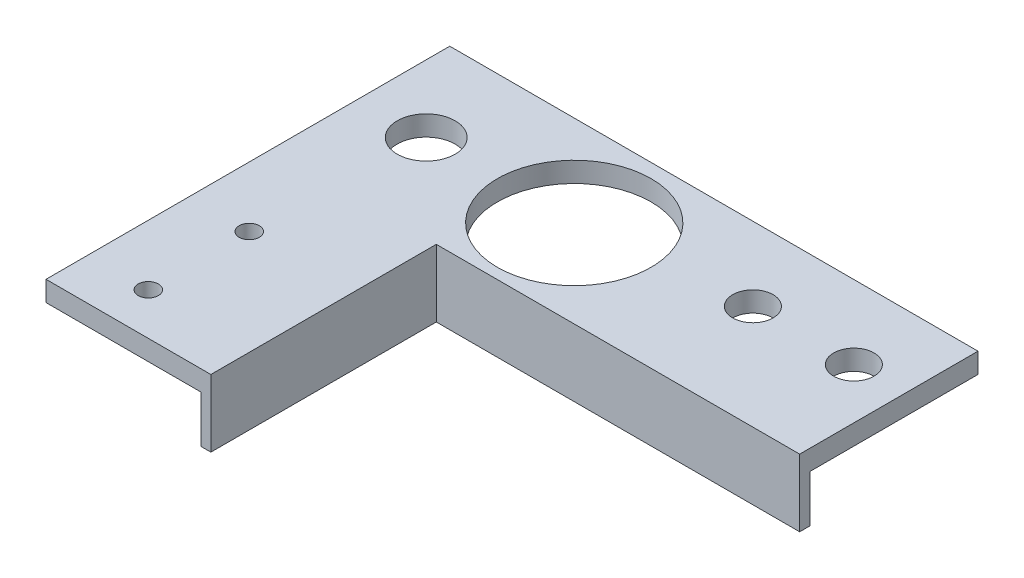
ISO-10303-21;
HEADER;
FILE_DESCRIPTION(('STEP AP214'),'2;1');
FILE_NAME('part.step','',(''),(''),'','','');
FILE_SCHEMA(('AUTOMOTIVE_DESIGN { 1 0 10303 214 1 1 1 1 }'));
ENDSEC;
DATA;
#1=APPLICATION_CONTEXT('core data for automotive mechanical design processes');
#2=APPLICATION_PROTOCOL_DEFINITION('international standard','automotive_design',2000,#1);
#3=PRODUCT_CONTEXT('',#1,'mechanical');
#4=PRODUCT('Part','Part','',(#3));
#5=PRODUCT_RELATED_PRODUCT_CATEGORY('part','',(#4));
#6=PRODUCT_DEFINITION_FORMATION('','',#4);
#7=PRODUCT_DEFINITION_CONTEXT('part definition',#1,'design');
#8=PRODUCT_DEFINITION('design','',#6,#7);
#9=PRODUCT_DEFINITION_SHAPE('','',#8);
#10=(LENGTH_UNIT() NAMED_UNIT(*) SI_UNIT(.MILLI.,.METRE.));
#11=(NAMED_UNIT(*) PLANE_ANGLE_UNIT() SI_UNIT($,.RADIAN.));
#12=(NAMED_UNIT(*) SI_UNIT($,.STERADIAN.) SOLID_ANGLE_UNIT());
#13=UNCERTAINTY_MEASURE_WITH_UNIT(LENGTH_MEASURE(1.E-05),#10,'distance_accuracy_value','');
#14=(GEOMETRIC_REPRESENTATION_CONTEXT(3) GLOBAL_UNCERTAINTY_ASSIGNED_CONTEXT((#13)) GLOBAL_UNIT_ASSIGNED_CONTEXT((#10,
#11,#12)) REPRESENTATION_CONTEXT('',''));
#15=CARTESIAN_POINT('',(0.,0.,0.));
#16=DIRECTION('',(0.,0.,1.));
#17=DIRECTION('',(1.,0.,0.));
#18=AXIS2_PLACEMENT_3D('',#15,#16,#17);
#19=CARTESIAN_POINT('',(39.25,3.,-29.));
#20=DIRECTION('',(-1.,0.,0.));
#21=DIRECTION('',(0.,0.,-1.));
#22=AXIS2_PLACEMENT_3D('',#19,#20,#21);
#23=PLANE('',#22);
#24=DIRECTION('',(0.,0.,1.));
#25=VECTOR('',#24,1.);
#26=CARTESIAN_POINT('',(39.25,0.,-29.));
#27=LINE('',#26,#25);
#28=CARTESIAN_POINT('',(39.25,0.,-31.));
#29=VERTEX_POINT('',#28);
#30=CARTESIAN_POINT('',(39.25,0.,-6.));
#31=VERTEX_POINT('',#30);
#32=EDGE_CURVE('E94',#29,#31,#27,.T.);
#33=ORIENTED_EDGE('',*,*,#32,.F.);
#34=DIRECTION('',(0.,1.,0.));
#35=VECTOR('',#34,1.);
#36=CARTESIAN_POINT('',(39.25,0.,-31.));
#37=LINE('',#36,#35);
#38=CARTESIAN_POINT('',(39.25,3.,-31.));
#39=VERTEX_POINT('',#38);
#40=EDGE_CURVE('E118',#29,#39,#37,.T.);
#41=ORIENTED_EDGE('',*,*,#40,.T.);
#42=DIRECTION('',(0.,0.,1.));
#43=VECTOR('',#42,1.);
#44=CARTESIAN_POINT('',(39.25,3.,-29.));
#45=LINE('',#44,#43);
#46=CARTESIAN_POINT('',(39.25,3.,-4.5));
#47=VERTEX_POINT('',#46);
#48=EDGE_CURVE('E103',#39,#47,#45,.T.);
#49=ORIENTED_EDGE('',*,*,#48,.T.);
#50=DIRECTION('',(0.,1.,0.));
#51=VECTOR('',#50,1.);
#52=CARTESIAN_POINT('',(39.25,-7.,-4.5));
#53=LINE('',#52,#51);
#54=CARTESIAN_POINT('',(39.25,-7.,-4.5));
#55=VERTEX_POINT('',#54);
#56=EDGE_CURVE('E147',#55,#47,#53,.T.);
#57=ORIENTED_EDGE('',*,*,#56,.F.);
#58=DIRECTION('',(0.,0.,1.));
#59=VECTOR('',#58,1.);
#60=CARTESIAN_POINT('',(39.25,-7.,-6.));
#61=LINE('',#60,#59);
#62=CARTESIAN_POINT('',(39.25,-7.,-6.));
#63=VERTEX_POINT('',#62);
#64=EDGE_CURVE('E129',#63,#55,#61,.T.);
#65=ORIENTED_EDGE('',*,*,#64,.F.);
#66=DIRECTION('',(0.,1.,0.));
#67=VECTOR('',#66,1.);
#68=CARTESIAN_POINT('',(39.25,-7.,-6.));
#69=LINE('',#68,#67);
#70=EDGE_CURVE('E77',#63,#31,#69,.T.);
#71=ORIENTED_EDGE('',*,*,#70,.T.);
#72=EDGE_LOOP('',(#33,#41,#49,#57,#65,#71));
#73=FACE_BOUND('',#72,.T.);
#74=ADVANCED_FACE('F35',(#73),#23,.F.);
#75=CARTESIAN_POINT('',(-16.25,3.,29.));
#76=DIRECTION('',(0.,0.,-1.));
#77=DIRECTION('',(1.,0.,0.));
#78=AXIS2_PLACEMENT_3D('',#75,#76,#77);
#79=PLANE('',#78);
#80=DIRECTION('',(-1.,0.,0.));
#81=VECTOR('',#80,1.);
#82=CARTESIAN_POINT('',(-16.25,0.,29.));
#83=LINE('',#82,#81);
#84=CARTESIAN_POINT('',(-16.25,0.,29.));
#85=VERTEX_POINT('',#84);
#86=CARTESIAN_POINT('',(-39.25,0.,29.));
#87=VERTEX_POINT('',#86);
#88=EDGE_CURVE('E88',#85,#87,#83,.T.);
#89=ORIENTED_EDGE('',*,*,#88,.F.);
#90=DIRECTION('',(0.,1.,0.));
#91=VECTOR('',#90,1.);
#92=CARTESIAN_POINT('',(-16.25,-7.,29.));
#93=LINE('',#92,#91);
#94=CARTESIAN_POINT('',(-16.25,-7.,29.));
#95=VERTEX_POINT('',#94);
#96=EDGE_CURVE('E78',#95,#85,#93,.T.);
#97=ORIENTED_EDGE('',*,*,#96,.F.);
#98=DIRECTION('',(-1.,0.,0.));
#99=VECTOR('',#98,1.);
#100=CARTESIAN_POINT('',(-14.75,-7.,29.));
#101=LINE('',#100,#99);
#102=CARTESIAN_POINT('',(-14.75,-7.,29.));
#103=VERTEX_POINT('',#102);
#104=EDGE_CURVE('E122',#103,#95,#101,.T.);
#105=ORIENTED_EDGE('',*,*,#104,.F.);
#106=DIRECTION('',(0.,1.,0.));
#107=VECTOR('',#106,1.);
#108=CARTESIAN_POINT('',(-14.75,-7.,29.));
#109=LINE('',#108,#107);
#110=CARTESIAN_POINT('',(-14.75,3.,29.));
#111=VERTEX_POINT('',#110);
#112=EDGE_CURVE('E140',#103,#111,#109,.T.);
#113=ORIENTED_EDGE('',*,*,#112,.T.);
#114=DIRECTION('',(-1.,0.,0.));
#115=VECTOR('',#114,1.);
#116=CARTESIAN_POINT('',(-16.25,3.,29.));
#117=LINE('',#116,#115);
#118=CARTESIAN_POINT('',(-39.25,3.,29.));
#119=VERTEX_POINT('',#118);
#120=EDGE_CURVE('E176',#111,#119,#117,.T.);
#121=ORIENTED_EDGE('',*,*,#120,.T.);
#122=DIRECTION('',(0.,-1.,0.));
#123=VECTOR('',#122,1.);
#124=CARTESIAN_POINT('',(-39.25,3.,29.));
#125=LINE('',#124,#123);
#126=EDGE_CURVE('E11',#119,#87,#125,.T.);
#127=ORIENTED_EDGE('',*,*,#126,.T.);
#128=EDGE_LOOP('',(#89,#97,#105,#113,#121,#127));
#129=FACE_BOUND('',#128,.T.);
#130=ADVANCED_FACE('F219',(#129),#79,.F.);
#131=CARTESIAN_POINT('',(-39.25,3.,29.));
#132=DIRECTION('',(1.,0.,0.));
#133=DIRECTION('',(0.,0.,1.));
#134=AXIS2_PLACEMENT_3D('',#131,#132,#133);
#135=PLANE('',#134);
#136=DIRECTION('',(0.,0.,-1.));
#137=VECTOR('',#136,1.);
#138=CARTESIAN_POINT('',(-39.25,0.,29.));
#139=LINE('',#138,#137);
#140=CARTESIAN_POINT('',(-39.25,0.,-31.));
#141=VERTEX_POINT('',#140);
#142=EDGE_CURVE('E101',#87,#141,#139,.T.);
#143=ORIENTED_EDGE('',*,*,#142,.F.);
#144=ORIENTED_EDGE('',*,*,#126,.F.);
#145=DIRECTION('',(0.,0.,-1.));
#146=VECTOR('',#145,1.);
#147=CARTESIAN_POINT('',(-39.25,3.,29.));
#148=LINE('',#147,#146);
#149=CARTESIAN_POINT('',(-39.25,3.,-31.));
#150=VERTEX_POINT('',#149);
#151=EDGE_CURVE('E44',#119,#150,#148,.T.);
#152=ORIENTED_EDGE('',*,*,#151,.T.);
#153=DIRECTION('',(0.,-1.,0.));
#154=VECTOR('',#153,1.);
#155=CARTESIAN_POINT('',(-39.25,0.,-31.));
#156=LINE('',#155,#154);
#157=EDGE_CURVE('E184',#150,#141,#156,.T.);
#158=ORIENTED_EDGE('',*,*,#157,.T.);
#159=EDGE_LOOP('',(#143,#144,#152,#158));
#160=FACE_BOUND('',#159,.T.);
#161=ADVANCED_FACE('F181',(#160),#135,.F.);
#162=CARTESIAN_POINT('',(0.,3.,0.));
#163=DIRECTION('',(0.,1.,0.));
#164=DIRECTION('',(0.,0.,-1.));
#165=AXIS2_PLACEMENT_3D('',#162,#163,#164);
#166=PLANE('',#165);
#167=CARTESIAN_POINT('',(-29.2499999999999,3.,-17.5));
#168=DIRECTION('',(0.,-1.,0.));
#169=DIRECTION('',(0.,0.,-1.));
#170=AXIS2_PLACEMENT_3D('',#167,#168,#169);
#171=CIRCLE('',#170,4.30465448526568);
#172=CARTESIAN_POINT('',(-29.2499999999999,3.,-21.8046544852657));
#173=VERTEX_POINT('',#172);
#174=EDGE_CURVE('E235',#173,#173,#171,.T.);
#175=ORIENTED_EDGE('',*,*,#174,.T.);
#176=EDGE_LOOP('',(#175));
#177=FACE_BOUND('',#176,.T.);
#178=CARTESIAN_POINT('',(-7.25000000000003,3.,-17.4999999999999));
#179=DIRECTION('',(0.,-1.,0.));
#180=DIRECTION('',(0.,0.,-1.));
#181=AXIS2_PLACEMENT_3D('',#178,#179,#180);
#182=CIRCLE('',#181,11.4206212485819);
#183=CARTESIAN_POINT('',(-7.25000000000003,3.,-28.9206212485818));
#184=VERTEX_POINT('',#183);
#185=EDGE_CURVE('E107',#184,#184,#182,.T.);
#186=ORIENTED_EDGE('',*,*,#185,.T.);
#187=EDGE_LOOP('',(#186));
#188=FACE_BOUND('',#187,.T.);
#189=CARTESIAN_POINT('',(-30.3,3.,7.75));
#190=DIRECTION('',(0.,-1.,0.));
#191=DIRECTION('',(0.,0.,-1.));
#192=AXIS2_PLACEMENT_3D('',#189,#190,#191);
#193=CIRCLE('',#192,1.5);
#194=CARTESIAN_POINT('',(-30.3,3.,6.25));
#195=VERTEX_POINT('',#194);
#196=EDGE_CURVE('E143',#195,#195,#193,.T.);
#197=ORIENTED_EDGE('',*,*,#196,.T.);
#198=EDGE_LOOP('',(#197));
#199=FACE_BOUND('',#198,.T.);
#200=CARTESIAN_POINT('',(-30.3,3.,22.75));
#201=DIRECTION('',(0.,-1.,0.));
#202=DIRECTION('',(0.,0.,-1.));
#203=AXIS2_PLACEMENT_3D('',#200,#201,#202);
#204=CIRCLE('',#203,1.5);
#205=CARTESIAN_POINT('',(-30.3,3.,21.25));
#206=VERTEX_POINT('',#205);
#207=EDGE_CURVE('E155',#206,#206,#204,.T.);
#208=ORIENTED_EDGE('',*,*,#207,.T.);
#209=EDGE_LOOP('',(#208));
#210=FACE_BOUND('',#209,.T.);
#211=CARTESIAN_POINT('',(16.75,3.,-20.05));
#212=DIRECTION('',(0.,-1.,0.));
#213=DIRECTION('',(0.,0.,-1.));
#214=AXIS2_PLACEMENT_3D('',#211,#212,#213);
#215=CIRCLE('',#214,3.);
#216=CARTESIAN_POINT('',(16.75,3.,-23.05));
#217=VERTEX_POINT('',#216);
#218=EDGE_CURVE('E161',#217,#217,#215,.T.);
#219=ORIENTED_EDGE('',*,*,#218,.T.);
#220=EDGE_LOOP('',(#219));
#221=FACE_BOUND('',#220,.T.);
#222=CARTESIAN_POINT('',(31.75,3.,-20.05));
#223=DIRECTION('',(0.,-1.,0.));
#224=DIRECTION('',(0.,0.,-1.));
#225=AXIS2_PLACEMENT_3D('',#222,#223,#224);
#226=CIRCLE('',#225,3.);
#227=CARTESIAN_POINT('',(31.75,3.,-23.05));
#228=VERTEX_POINT('',#227);
#229=EDGE_CURVE('E167',#228,#228,#226,.T.);
#230=ORIENTED_EDGE('',*,*,#229,.T.);
#231=EDGE_LOOP('',(#230));
#232=FACE_BOUND('',#231,.T.);
#233=ORIENTED_EDGE('',*,*,#151,.F.);
#234=ORIENTED_EDGE('',*,*,#120,.F.);
#235=DIRECTION('',(0.,0.,1.));
#236=VECTOR('',#235,1.);
#237=CARTESIAN_POINT('',(-14.75,3.,-4.50000000000001));
#238=LINE('',#237,#236);
#239=CARTESIAN_POINT('',(-14.75,3.,-4.50000000000001));
#240=VERTEX_POINT('',#239);
#241=EDGE_CURVE('E111',#240,#111,#238,.T.);
#242=ORIENTED_EDGE('',*,*,#241,.F.);
#243=DIRECTION('',(-1.,0.,0.));
#244=VECTOR('',#243,1.);
#245=CARTESIAN_POINT('',(39.25,3.,-4.5));
#246=LINE('',#245,#244);
#247=EDGE_CURVE('E106',#47,#240,#246,.T.);
#248=ORIENTED_EDGE('',*,*,#247,.F.);
#249=ORIENTED_EDGE('',*,*,#48,.F.);
#250=DIRECTION('',(-1.,0.,0.));
#251=VECTOR('',#250,1.);
#252=CARTESIAN_POINT('',(-39.25,3.,-31.));
#253=LINE('',#252,#251);
#254=EDGE_CURVE('E114',#39,#150,#253,.T.);
#255=ORIENTED_EDGE('',*,*,#254,.T.);
#256=EDGE_LOOP('',(#233,#234,#242,#248,#249,#255));
#257=FACE_BOUND('',#256,.T.);
#258=ADVANCED_FACE('F217',(#177,#188,#199,#210,#221,#232,#257),#166,.T.);
#259=CARTESIAN_POINT('',(0.,0.,0.));
#260=DIRECTION('',(0.,1.,0.));
#261=DIRECTION('',(0.,0.,-1.));
#262=AXIS2_PLACEMENT_3D('',#259,#260,#261);
#263=PLANE('',#262);
#264=CARTESIAN_POINT('',(-29.2499999999999,0.,-17.5));
#265=DIRECTION('',(0.,-1.,0.));
#266=DIRECTION('',(0.,0.,-1.));
#267=AXIS2_PLACEMENT_3D('',#264,#265,#266);
#268=CIRCLE('',#267,4.30465448526568);
#269=CARTESIAN_POINT('',(-29.2499999999999,0.,-21.8046544852657));
#270=VERTEX_POINT('',#269);
#271=EDGE_CURVE('E38',#270,#270,#268,.T.);
#272=ORIENTED_EDGE('',*,*,#271,.F.);
#273=EDGE_LOOP('',(#272));
#274=FACE_BOUND('',#273,.T.);
#275=CARTESIAN_POINT('',(-7.25000000000003,0.,-17.4999999999999));
#276=DIRECTION('',(0.,-1.,0.));
#277=DIRECTION('',(0.,0.,-1.));
#278=AXIS2_PLACEMENT_3D('',#275,#276,#277);
#279=CIRCLE('',#278,11.4206212485819);
#280=CARTESIAN_POINT('',(-7.25000000000003,0.,-28.9206212485818));
#281=VERTEX_POINT('',#280);
#282=EDGE_CURVE('E104',#281,#281,#279,.T.);
#283=ORIENTED_EDGE('',*,*,#282,.F.);
#284=EDGE_LOOP('',(#283));
#285=FACE_BOUND('',#284,.T.);
#286=CARTESIAN_POINT('',(-30.3,0.,7.75));
#287=DIRECTION('',(0.,-1.,0.));
#288=DIRECTION('',(0.,0.,-1.));
#289=AXIS2_PLACEMENT_3D('',#286,#287,#288);
#290=CIRCLE('',#289,1.5);
#291=CARTESIAN_POINT('',(-30.3,0.,6.25));
#292=VERTEX_POINT('',#291);
#293=EDGE_CURVE('E152',#292,#292,#290,.T.);
#294=ORIENTED_EDGE('',*,*,#293,.F.);
#295=EDGE_LOOP('',(#294));
#296=FACE_BOUND('',#295,.T.);
#297=CARTESIAN_POINT('',(-30.3,0.,22.75));
#298=DIRECTION('',(0.,-1.,0.));
#299=DIRECTION('',(0.,0.,-1.));
#300=AXIS2_PLACEMENT_3D('',#297,#298,#299);
#301=CIRCLE('',#300,1.5);
#302=CARTESIAN_POINT('',(-30.3,0.,21.25));
#303=VERTEX_POINT('',#302);
#304=EDGE_CURVE('E158',#303,#303,#301,.T.);
#305=ORIENTED_EDGE('',*,*,#304,.F.);
#306=EDGE_LOOP('',(#305));
#307=FACE_BOUND('',#306,.T.);
#308=CARTESIAN_POINT('',(16.75,0.,-20.05));
#309=DIRECTION('',(0.,-1.,0.));
#310=DIRECTION('',(0.,0.,-1.));
#311=AXIS2_PLACEMENT_3D('',#308,#309,#310);
#312=CIRCLE('',#311,3.);
#313=CARTESIAN_POINT('',(16.75,0.,-23.05));
#314=VERTEX_POINT('',#313);
#315=EDGE_CURVE('E164',#314,#314,#312,.T.);
#316=ORIENTED_EDGE('',*,*,#315,.F.);
#317=EDGE_LOOP('',(#316));
#318=FACE_BOUND('',#317,.T.);
#319=CARTESIAN_POINT('',(31.75,0.,-20.05));
#320=DIRECTION('',(0.,-1.,0.));
#321=DIRECTION('',(0.,0.,-1.));
#322=AXIS2_PLACEMENT_3D('',#319,#320,#321);
#323=CIRCLE('',#322,3.);
#324=CARTESIAN_POINT('',(31.75,0.,-23.05));
#325=VERTEX_POINT('',#324);
#326=EDGE_CURVE('E96',#325,#325,#323,.T.);
#327=ORIENTED_EDGE('',*,*,#326,.F.);
#328=EDGE_LOOP('',(#327));
#329=FACE_BOUND('',#328,.T.);
#330=ORIENTED_EDGE('',*,*,#32,.T.);
#331=DIRECTION('',(-1.,0.,0.));
#332=VECTOR('',#331,1.);
#333=CARTESIAN_POINT('',(-16.25,0.,-6.));
#334=LINE('',#333,#332);
#335=CARTESIAN_POINT('',(-16.25,0.,-6.));
#336=VERTEX_POINT('',#335);
#337=EDGE_CURVE('E70',#31,#336,#334,.T.);
#338=ORIENTED_EDGE('',*,*,#337,.T.);
#339=DIRECTION('',(0.,0.,1.));
#340=VECTOR('',#339,1.);
#341=CARTESIAN_POINT('',(-16.25,0.,29.));
#342=LINE('',#341,#340);
#343=EDGE_CURVE('E82',#336,#85,#342,.T.);
#344=ORIENTED_EDGE('',*,*,#343,.T.);
#345=ORIENTED_EDGE('',*,*,#88,.T.);
#346=ORIENTED_EDGE('',*,*,#142,.T.);
#347=DIRECTION('',(1.,0.,0.));
#348=VECTOR('',#347,1.);
#349=CARTESIAN_POINT('',(-39.25,0.,-31.));
#350=LINE('',#349,#348);
#351=EDGE_CURVE('E231',#141,#29,#350,.T.);
#352=ORIENTED_EDGE('',*,*,#351,.T.);
#353=EDGE_LOOP('',(#330,#338,#344,#345,#346,#352));
#354=FACE_BOUND('',#353,.T.);
#355=ADVANCED_FACE('F91',(#274,#285,#296,#307,#318,#329,#354),#263,.F.);
#356=CARTESIAN_POINT('',(31.75,0.,-20.05));
#357=DIRECTION('',(0.,1.,0.));
#358=DIRECTION('',(0.,0.,-1.));
#359=AXIS2_PLACEMENT_3D('',#356,#357,#358);
#360=CYLINDRICAL_SURFACE('',#359,3.);
#361=ORIENTED_EDGE('',*,*,#326,.T.);
#362=EDGE_LOOP('',(#361));
#363=FACE_BOUND('',#362,.T.);
#364=ORIENTED_EDGE('',*,*,#229,.F.);
#365=EDGE_LOOP('',(#364));
#366=FACE_BOUND('',#365,.T.);
#367=ADVANCED_FACE('F246',(#363,#366),#360,.F.);
#368=CARTESIAN_POINT('',(16.75,0.,-20.05));
#369=DIRECTION('',(0.,1.,0.));
#370=DIRECTION('',(0.,0.,-1.));
#371=AXIS2_PLACEMENT_3D('',#368,#369,#370);
#372=CYLINDRICAL_SURFACE('',#371,3.);
#373=ORIENTED_EDGE('',*,*,#315,.T.);
#374=EDGE_LOOP('',(#373));
#375=FACE_BOUND('',#374,.T.);
#376=ORIENTED_EDGE('',*,*,#218,.F.);
#377=EDGE_LOOP('',(#376));
#378=FACE_BOUND('',#377,.T.);
#379=ADVANCED_FACE('F259',(#375,#378),#372,.F.);
#380=CARTESIAN_POINT('',(-30.3,0.,22.75));
#381=DIRECTION('',(0.,1.,0.));
#382=DIRECTION('',(0.,0.,-1.));
#383=AXIS2_PLACEMENT_3D('',#380,#381,#382);
#384=CYLINDRICAL_SURFACE('',#383,1.5);
#385=ORIENTED_EDGE('',*,*,#304,.T.);
#386=EDGE_LOOP('',(#385));
#387=FACE_BOUND('',#386,.T.);
#388=ORIENTED_EDGE('',*,*,#207,.F.);
#389=EDGE_LOOP('',(#388));
#390=FACE_BOUND('',#389,.T.);
#391=ADVANCED_FACE('F308',(#387,#390),#384,.F.);
#392=CARTESIAN_POINT('',(-30.3,0.,7.75));
#393=DIRECTION('',(0.,1.,0.));
#394=DIRECTION('',(0.,0.,-1.));
#395=AXIS2_PLACEMENT_3D('',#392,#393,#394);
#396=CYLINDRICAL_SURFACE('',#395,1.5);
#397=ORIENTED_EDGE('',*,*,#293,.T.);
#398=EDGE_LOOP('',(#397));
#399=FACE_BOUND('',#398,.T.);
#400=ORIENTED_EDGE('',*,*,#196,.F.);
#401=EDGE_LOOP('',(#400));
#402=FACE_BOUND('',#401,.T.);
#403=ADVANCED_FACE('F318',(#399,#402),#396,.F.);
#404=CARTESIAN_POINT('',(-16.25,-7.,-6.));
#405=DIRECTION('',(0.,0.,-1.));
#406=DIRECTION('',(1.,0.,0.));
#407=AXIS2_PLACEMENT_3D('',#404,#405,#406);
#408=PLANE('',#407);
#409=ORIENTED_EDGE('',*,*,#337,.F.);
#410=ORIENTED_EDGE('',*,*,#70,.F.);
#411=DIRECTION('',(1.,0.,0.));
#412=VECTOR('',#411,1.);
#413=CARTESIAN_POINT('',(-16.25,-7.,-6.));
#414=LINE('',#413,#412);
#415=CARTESIAN_POINT('',(-16.25,-7.,-6.));
#416=VERTEX_POINT('',#415);
#417=EDGE_CURVE('E74',#416,#63,#414,.T.);
#418=ORIENTED_EDGE('',*,*,#417,.F.);
#419=DIRECTION('',(0.,1.,0.));
#420=VECTOR('',#419,1.);
#421=CARTESIAN_POINT('',(-16.25,-7.,-6.));
#422=LINE('',#421,#420);
#423=EDGE_CURVE('E65',#416,#336,#422,.T.);
#424=ORIENTED_EDGE('',*,*,#423,.T.);
#425=EDGE_LOOP('',(#409,#410,#418,#424));
#426=FACE_BOUND('',#425,.T.);
#427=ADVANCED_FACE('F67',(#426),#408,.T.);
#428=CARTESIAN_POINT('',(-16.25,-7.,29.));
#429=DIRECTION('',(-1.,0.,0.));
#430=DIRECTION('',(0.,0.,-1.));
#431=AXIS2_PLACEMENT_3D('',#428,#429,#430);
#432=PLANE('',#431);
#433=ORIENTED_EDGE('',*,*,#343,.F.);
#434=ORIENTED_EDGE('',*,*,#423,.F.);
#435=DIRECTION('',(0.,0.,-1.));
#436=VECTOR('',#435,1.);
#437=CARTESIAN_POINT('',(-16.25,-7.,29.));
#438=LINE('',#437,#436);
#439=EDGE_CURVE('E125',#95,#416,#438,.T.);
#440=ORIENTED_EDGE('',*,*,#439,.F.);
#441=ORIENTED_EDGE('',*,*,#96,.T.);
#442=EDGE_LOOP('',(#433,#434,#440,#441));
#443=FACE_BOUND('',#442,.T.);
#444=ADVANCED_FACE('F83',(#443),#432,.T.);
#445=CARTESIAN_POINT('',(-14.75,-7.,-4.50000000000001));
#446=DIRECTION('',(1.,0.,0.));
#447=DIRECTION('',(0.,0.,1.));
#448=AXIS2_PLACEMENT_3D('',#445,#446,#447);
#449=PLANE('',#448);
#450=ORIENTED_EDGE('',*,*,#241,.T.);
#451=ORIENTED_EDGE('',*,*,#112,.F.);
#452=DIRECTION('',(0.,0.,1.));
#453=VECTOR('',#452,1.);
#454=CARTESIAN_POINT('',(-14.75,-7.,-4.50000000000001));
#455=LINE('',#454,#453);
#456=CARTESIAN_POINT('',(-14.75,-7.,-4.50000000000001));
#457=VERTEX_POINT('',#456);
#458=EDGE_CURVE('E135',#457,#103,#455,.T.);
#459=ORIENTED_EDGE('',*,*,#458,.F.);
#460=DIRECTION('',(0.,1.,0.));
#461=VECTOR('',#460,1.);
#462=CARTESIAN_POINT('',(-14.75,-7.,-4.50000000000001));
#463=LINE('',#462,#461);
#464=EDGE_CURVE('E144',#457,#240,#463,.T.);
#465=ORIENTED_EDGE('',*,*,#464,.T.);
#466=EDGE_LOOP('',(#450,#451,#459,#465));
#467=FACE_BOUND('',#466,.T.);
#468=ADVANCED_FACE('F213',(#467),#449,.T.);
#469=CARTESIAN_POINT('',(39.25,-7.,-4.5));
#470=DIRECTION('',(0.,0.,1.));
#471=DIRECTION('',(-1.,0.,0.));
#472=AXIS2_PLACEMENT_3D('',#469,#470,#471);
#473=PLANE('',#472);
#474=ORIENTED_EDGE('',*,*,#247,.T.);
#475=ORIENTED_EDGE('',*,*,#464,.F.);
#476=DIRECTION('',(-1.,0.,0.));
#477=VECTOR('',#476,1.);
#478=CARTESIAN_POINT('',(39.25,-7.,-4.5));
#479=LINE('',#478,#477);
#480=EDGE_CURVE('E132',#55,#457,#479,.T.);
#481=ORIENTED_EDGE('',*,*,#480,.F.);
#482=ORIENTED_EDGE('',*,*,#56,.T.);
#483=EDGE_LOOP('',(#474,#475,#481,#482));
#484=FACE_BOUND('',#483,.T.);
#485=ADVANCED_FACE('F225',(#484),#473,.T.);
#486=CARTESIAN_POINT('',(0.,-7.,0.));
#487=DIRECTION('',(0.,1.,0.));
#488=DIRECTION('',(0.,0.,-1.));
#489=AXIS2_PLACEMENT_3D('',#486,#487,#488);
#490=PLANE('',#489);
#491=ORIENTED_EDGE('',*,*,#104,.T.);
#492=ORIENTED_EDGE('',*,*,#439,.T.);
#493=ORIENTED_EDGE('',*,*,#417,.T.);
#494=ORIENTED_EDGE('',*,*,#64,.T.);
#495=ORIENTED_EDGE('',*,*,#480,.T.);
#496=ORIENTED_EDGE('',*,*,#458,.T.);
#497=EDGE_LOOP('',(#491,#492,#493,#494,#495,#496));
#498=FACE_BOUND('',#497,.T.);
#499=ADVANCED_FACE('F221',(#498),#490,.F.);
#500=CARTESIAN_POINT('',(-7.25000000000003,-7.,-17.4999999999999));
#501=DIRECTION('',(0.,1.,0.));
#502=DIRECTION('',(0.,0.,-1.));
#503=AXIS2_PLACEMENT_3D('',#500,#501,#502);
#504=CYLINDRICAL_SURFACE('',#503,11.4206212485819);
#505=ORIENTED_EDGE('',*,*,#185,.F.);
#506=EDGE_LOOP('',(#505));
#507=FACE_BOUND('',#506,.T.);
#508=ORIENTED_EDGE('',*,*,#282,.T.);
#509=EDGE_LOOP('',(#508));
#510=FACE_BOUND('',#509,.T.);
#511=ADVANCED_FACE('F369',(#507,#510),#504,.F.);
#512=CARTESIAN_POINT('',(0.,0.,-31.));
#513=DIRECTION('',(0.,0.,1.));
#514=DIRECTION('',(-1.,0.,0.));
#515=AXIS2_PLACEMENT_3D('',#512,#513,#514);
#516=PLANE('',#515);
#517=ORIENTED_EDGE('',*,*,#157,.F.);
#518=ORIENTED_EDGE('',*,*,#254,.F.);
#519=ORIENTED_EDGE('',*,*,#40,.F.);
#520=ORIENTED_EDGE('',*,*,#351,.F.);
#521=EDGE_LOOP('',(#517,#518,#519,#520));
#522=FACE_BOUND('',#521,.T.);
#523=ADVANCED_FACE('F378',(#522),#516,.F.);
#524=CARTESIAN_POINT('',(-29.2499999999999,-7.,-17.5));
#525=DIRECTION('',(0.,1.,0.));
#526=DIRECTION('',(0.,0.,-1.));
#527=AXIS2_PLACEMENT_3D('',#524,#525,#526);
#528=CYLINDRICAL_SURFACE('',#527,4.30465448526568);
#529=ORIENTED_EDGE('',*,*,#174,.F.);
#530=EDGE_LOOP('',(#529));
#531=FACE_BOUND('',#530,.T.);
#532=ORIENTED_EDGE('',*,*,#271,.T.);
#533=EDGE_LOOP('',(#532));
#534=FACE_BOUND('',#533,.T.);
#535=ADVANCED_FACE('F242',(#531,#534),#528,.F.);
#536=CLOSED_SHELL('',(#74,#130,#161,#258,#355,#367,#379,#391,#403,#427,#444,#468,#485,#499,#511,
#523,#535));
#537=MANIFOLD_SOLID_BREP('B2',#536);
#538=ADVANCED_BREP_SHAPE_REPRESENTATION('',(#18,#537),#14);
#539=SHAPE_DEFINITION_REPRESENTATION(#9,#538);
ENDSEC;
END-ISO-10303-21;
